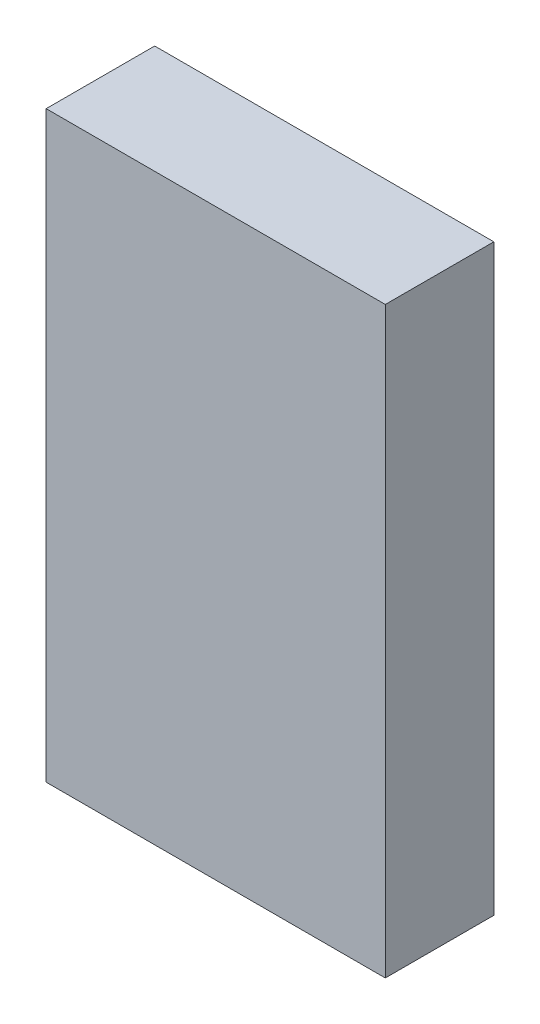
ISO-10303-21;
HEADER;
FILE_DESCRIPTION(('STEP AP214'),'2;1');
FILE_NAME('part.step','',(''),(''),'','','');
FILE_SCHEMA(('AUTOMOTIVE_DESIGN { 1 0 10303 214 1 1 1 1 }'));
ENDSEC;
DATA;
#1=APPLICATION_CONTEXT('core data for automotive mechanical design processes');
#2=APPLICATION_PROTOCOL_DEFINITION('international standard','automotive_design',2000,#1);
#3=PRODUCT_CONTEXT('',#1,'mechanical');
#4=PRODUCT('Part','Part','',(#3));
#5=PRODUCT_RELATED_PRODUCT_CATEGORY('part','',(#4));
#6=PRODUCT_DEFINITION_FORMATION('','',#4);
#7=PRODUCT_DEFINITION_CONTEXT('part definition',#1,'design');
#8=PRODUCT_DEFINITION('design','',#6,#7);
#9=PRODUCT_DEFINITION_SHAPE('','',#8);
#10=(LENGTH_UNIT() NAMED_UNIT(*) SI_UNIT(.MILLI.,.METRE.));
#11=(NAMED_UNIT(*) PLANE_ANGLE_UNIT() SI_UNIT($,.RADIAN.));
#12=(NAMED_UNIT(*) SI_UNIT($,.STERADIAN.) SOLID_ANGLE_UNIT());
#13=UNCERTAINTY_MEASURE_WITH_UNIT(LENGTH_MEASURE(1.E-05),#10,'distance_accuracy_value','');
#14=(GEOMETRIC_REPRESENTATION_CONTEXT(3) GLOBAL_UNCERTAINTY_ASSIGNED_CONTEXT((#13)) GLOBAL_UNIT_ASSIGNED_CONTEXT((#10,
#11,#12)) REPRESENTATION_CONTEXT('',''));
#15=CARTESIAN_POINT('',(0.,0.,0.));
#16=DIRECTION('',(0.,0.,1.));
#17=DIRECTION('',(1.,0.,0.));
#18=AXIS2_PLACEMENT_3D('',#15,#16,#17);
#19=CARTESIAN_POINT('',(-12.5000004,21.50000018,0.));
#20=DIRECTION('',(1.,0.,0.));
#21=DIRECTION('',(0.,-1.,0.));
#22=AXIS2_PLACEMENT_3D('',#19,#20,#21);
#23=PLANE('',#22);
#24=DIRECTION('',(0.,-1.,0.));
#25=VECTOR('',#24,1.);
#26=CARTESIAN_POINT('',(-12.5000004,21.50000018,0.));
#27=LINE('',#26,#25);
#28=CARTESIAN_POINT('',(-12.5000004,21.50000018,0.));
#29=VERTEX_POINT('',#28);
#30=CARTESIAN_POINT('',(-12.5000004,-21.50000018,0.));
#31=VERTEX_POINT('',#30);
#32=EDGE_CURVE('E11',#29,#31,#27,.T.);
#33=ORIENTED_EDGE('',*,*,#32,.T.);
#34=DIRECTION('',(0.,0.,1.));
#35=VECTOR('',#34,1.);
#36=CARTESIAN_POINT('',(-12.5000004,-21.50000018,0.));
#37=LINE('',#36,#35);
#38=CARTESIAN_POINT('',(-12.5000004,-21.50000018,7.99999924));
#39=VERTEX_POINT('',#38);
#40=EDGE_CURVE('E24',#31,#39,#37,.T.);
#41=ORIENTED_EDGE('',*,*,#40,.T.);
#42=DIRECTION('',(0.,-1.,0.));
#43=VECTOR('',#42,1.);
#44=CARTESIAN_POINT('',(-12.5000004,21.50000018,7.99999924));
#45=LINE('',#44,#43);
#46=CARTESIAN_POINT('',(-12.5000004,21.50000018,7.99999924));
#47=VERTEX_POINT('',#46);
#48=EDGE_CURVE('E87',#47,#39,#45,.T.);
#49=ORIENTED_EDGE('',*,*,#48,.F.);
#50=DIRECTION('',(0.,0.,1.));
#51=VECTOR('',#50,1.);
#52=CARTESIAN_POINT('',(-12.5000004,21.50000018,0.));
#53=LINE('',#52,#51);
#54=EDGE_CURVE('E36',#29,#47,#53,.T.);
#55=ORIENTED_EDGE('',*,*,#54,.F.);
#56=EDGE_LOOP('',(#33,#41,#49,#55));
#57=FACE_BOUND('',#56,.T.);
#58=ADVANCED_FACE('F17',(#57),#23,.F.);
#59=CARTESIAN_POINT('',(-12.5000004,-21.50000018,0.));
#60=DIRECTION('',(0.,1.,0.));
#61=DIRECTION('',(1.,0.,0.));
#62=AXIS2_PLACEMENT_3D('',#59,#60,#61);
#63=PLANE('',#62);
#64=DIRECTION('',(1.,0.,0.));
#65=VECTOR('',#64,1.);
#66=CARTESIAN_POINT('',(-12.5000004,-21.50000018,0.));
#67=LINE('',#66,#65);
#68=CARTESIAN_POINT('',(12.5000004,-21.50000018,0.));
#69=VERTEX_POINT('',#68);
#70=EDGE_CURVE('E84',#31,#69,#67,.T.);
#71=ORIENTED_EDGE('',*,*,#70,.T.);
#72=DIRECTION('',(0.,0.,1.));
#73=VECTOR('',#72,1.);
#74=CARTESIAN_POINT('',(12.5000004,-21.50000018,0.));
#75=LINE('',#74,#73);
#76=CARTESIAN_POINT('',(12.5000004,-21.50000018,7.99999924));
#77=VERTEX_POINT('',#76);
#78=EDGE_CURVE('E82',#69,#77,#75,.T.);
#79=ORIENTED_EDGE('',*,*,#78,.T.);
#80=DIRECTION('',(1.,0.,0.));
#81=VECTOR('',#80,1.);
#82=CARTESIAN_POINT('',(-12.5000004,-21.50000018,7.99999924));
#83=LINE('',#82,#81);
#84=EDGE_CURVE('E62',#39,#77,#83,.T.);
#85=ORIENTED_EDGE('',*,*,#84,.F.);
#86=ORIENTED_EDGE('',*,*,#40,.F.);
#87=EDGE_LOOP('',(#71,#79,#85,#86));
#88=FACE_BOUND('',#87,.T.);
#89=ADVANCED_FACE('F89',(#88),#63,.F.);
#90=CARTESIAN_POINT('',(12.5000004,-21.50000018,0.));
#91=DIRECTION('',(-1.,0.,0.));
#92=DIRECTION('',(0.,1.,0.));
#93=AXIS2_PLACEMENT_3D('',#90,#91,#92);
#94=PLANE('',#93);
#95=DIRECTION('',(0.,1.,0.));
#96=VECTOR('',#95,1.);
#97=CARTESIAN_POINT('',(12.5000004,-21.50000018,0.));
#98=LINE('',#97,#96);
#99=CARTESIAN_POINT('',(12.5000004,21.50000018,0.));
#100=VERTEX_POINT('',#99);
#101=EDGE_CURVE('E71',#69,#100,#98,.T.);
#102=ORIENTED_EDGE('',*,*,#101,.T.);
#103=DIRECTION('',(0.,0.,1.));
#104=VECTOR('',#103,1.);
#105=CARTESIAN_POINT('',(12.5000004,21.50000018,0.));
#106=LINE('',#105,#104);
#107=CARTESIAN_POINT('',(12.5000004,21.50000018,7.99999924));
#108=VERTEX_POINT('',#107);
#109=EDGE_CURVE('E65',#100,#108,#106,.T.);
#110=ORIENTED_EDGE('',*,*,#109,.T.);
#111=DIRECTION('',(0.,1.,0.));
#112=VECTOR('',#111,1.);
#113=CARTESIAN_POINT('',(12.5000004,-21.50000018,7.99999924));
#114=LINE('',#113,#112);
#115=EDGE_CURVE('E57',#77,#108,#114,.T.);
#116=ORIENTED_EDGE('',*,*,#115,.F.);
#117=ORIENTED_EDGE('',*,*,#78,.F.);
#118=EDGE_LOOP('',(#102,#110,#116,#117));
#119=FACE_BOUND('',#118,.T.);
#120=ADVANCED_FACE('F69',(#119),#94,.F.);
#121=CARTESIAN_POINT('',(12.5000004,21.50000018,0.));
#122=DIRECTION('',(0.,-1.,0.));
#123=DIRECTION('',(-1.,0.,0.));
#124=AXIS2_PLACEMENT_3D('',#121,#122,#123);
#125=PLANE('',#124);
#126=DIRECTION('',(-1.,0.,0.));
#127=VECTOR('',#126,1.);
#128=CARTESIAN_POINT('',(12.5000004,21.50000018,0.));
#129=LINE('',#128,#127);
#130=EDGE_CURVE('E66',#100,#29,#129,.T.);
#131=ORIENTED_EDGE('',*,*,#130,.T.);
#132=ORIENTED_EDGE('',*,*,#54,.T.);
#133=DIRECTION('',(-1.,0.,0.));
#134=VECTOR('',#133,1.);
#135=CARTESIAN_POINT('',(12.5000004,21.50000018,7.99999924));
#136=LINE('',#135,#134);
#137=EDGE_CURVE('E61',#108,#47,#136,.T.);
#138=ORIENTED_EDGE('',*,*,#137,.F.);
#139=ORIENTED_EDGE('',*,*,#109,.F.);
#140=EDGE_LOOP('',(#131,#132,#138,#139));
#141=FACE_BOUND('',#140,.T.);
#142=ADVANCED_FACE('F76',(#141),#125,.F.);
#143=CARTESIAN_POINT('',(-12.5000004,21.50000018,0.));
#144=DIRECTION('',(0.,0.,-1.));
#145=DIRECTION('',(-1.,0.,0.));
#146=AXIS2_PLACEMENT_3D('',#143,#144,#145);
#147=PLANE('',#146);
#148=ORIENTED_EDGE('',*,*,#130,.F.);
#149=ORIENTED_EDGE('',*,*,#101,.F.);
#150=ORIENTED_EDGE('',*,*,#70,.F.);
#151=ORIENTED_EDGE('',*,*,#32,.F.);
#152=EDGE_LOOP('',(#148,#149,#150,#151));
#153=FACE_BOUND('',#152,.T.);
#154=ADVANCED_FACE('F91',(#153),#147,.T.);
#155=CARTESIAN_POINT('',(-12.5000004,21.50000018,7.99999924));
#156=DIRECTION('',(0.,0.,-1.));
#157=DIRECTION('',(-1.,0.,0.));
#158=AXIS2_PLACEMENT_3D('',#155,#156,#157);
#159=PLANE('',#158);
#160=ORIENTED_EDGE('',*,*,#48,.T.);
#161=ORIENTED_EDGE('',*,*,#84,.T.);
#162=ORIENTED_EDGE('',*,*,#115,.T.);
#163=ORIENTED_EDGE('',*,*,#137,.T.);
#164=EDGE_LOOP('',(#160,#161,#162,#163));
#165=FACE_BOUND('',#164,.T.);
#166=ADVANCED_FACE('F59',(#165),#159,.F.);
#167=CLOSED_SHELL('',(#58,#89,#120,#142,#154,#166));
#168=MANIFOLD_SOLID_BREP('B1',#167);
#169=ADVANCED_BREP_SHAPE_REPRESENTATION('',(#18,#168),#14);
#170=SHAPE_DEFINITION_REPRESENTATION(#9,#169);
ENDSEC;
END-ISO-10303-21;
